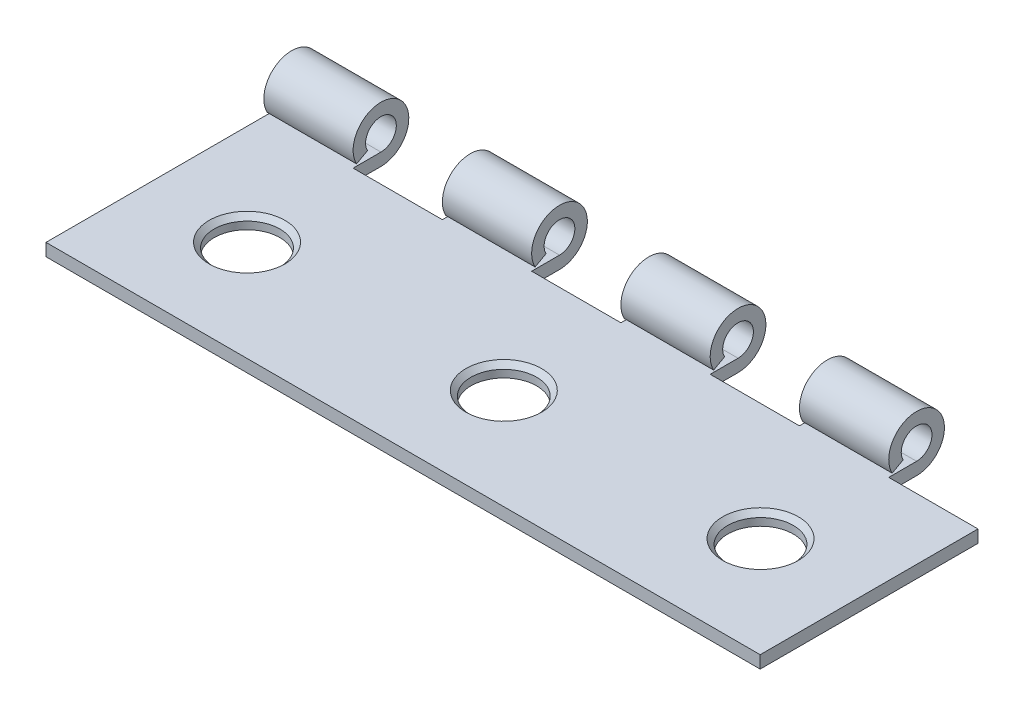
ISO-10303-21;
HEADER;
FILE_DESCRIPTION(('STEP AP214'),'2;1');
FILE_NAME('part.step','',(''),(''),'','','');
FILE_SCHEMA(('AUTOMOTIVE_DESIGN { 1 0 10303 214 1 1 1 1 }'));
ENDSEC;
DATA;
#1=APPLICATION_CONTEXT('core data for automotive mechanical design processes');
#2=APPLICATION_PROTOCOL_DEFINITION('international standard','automotive_design',2000,#1);
#3=PRODUCT_CONTEXT('',#1,'mechanical');
#4=PRODUCT('Part','Part','',(#3));
#5=PRODUCT_RELATED_PRODUCT_CATEGORY('part','',(#4));
#6=PRODUCT_DEFINITION_FORMATION('','',#4);
#7=PRODUCT_DEFINITION_CONTEXT('part definition',#1,'design');
#8=PRODUCT_DEFINITION('design','',#6,#7);
#9=PRODUCT_DEFINITION_SHAPE('','',#8);
#10=(LENGTH_UNIT() NAMED_UNIT(*) SI_UNIT(.MILLI.,.METRE.));
#11=(NAMED_UNIT(*) PLANE_ANGLE_UNIT() SI_UNIT($,.RADIAN.));
#12=(NAMED_UNIT(*) SI_UNIT($,.STERADIAN.) SOLID_ANGLE_UNIT());
#13=UNCERTAINTY_MEASURE_WITH_UNIT(LENGTH_MEASURE(1.E-05),#10,'distance_accuracy_value','');
#14=(GEOMETRIC_REPRESENTATION_CONTEXT(3) GLOBAL_UNCERTAINTY_ASSIGNED_CONTEXT((#13)) GLOBAL_UNIT_ASSIGNED_CONTEXT((#10,
#11,#12)) REPRESENTATION_CONTEXT('',''));
#15=CARTESIAN_POINT('',(0.,0.,0.));
#16=DIRECTION('',(0.,0.,1.));
#17=DIRECTION('',(1.,0.,0.));
#18=AXIS2_PLACEMENT_3D('',#15,#16,#17);
#19=CARTESIAN_POINT('',(25.4,0.,0.));
#20=DIRECTION('',(-1.,0.,0.));
#21=DIRECTION('',(0.,0.,1.));
#22=AXIS2_PLACEMENT_3D('',#19,#20,#21);
#23=CYLINDRICAL_SURFACE('',#22,1.0922);
#24=DIRECTION('',(-1.,0.,0.));
#25=VECTOR('',#24,1.);
#26=CARTESIAN_POINT('',(25.4,-0.527292872124992,0.956484744784869));
#27=LINE('',#26,#25);
#28=CARTESIAN_POINT('',(6.35,-0.527292872124992,0.956484744784869));
#29=VERTEX_POINT('',#28);
#30=CARTESIAN_POINT('',(0.,-0.527292872124992,0.956484744784869));
#31=VERTEX_POINT('',#30);
#32=EDGE_CURVE('E379',#29,#31,#27,.T.);
#33=ORIENTED_EDGE('',*,*,#32,.T.);
#34=CARTESIAN_POINT('',(0.,0.,0.));
#35=DIRECTION('',(1.,0.,0.));
#36=DIRECTION('',(0.,0.,-1.));
#37=AXIS2_PLACEMENT_3D('',#34,#35,#36);
#38=CIRCLE('',#37,1.0922);
#39=CARTESIAN_POINT('',(0.,-1.0922,0.));
#40=VERTEX_POINT('',#39);
#41=EDGE_CURVE('E311',#31,#40,#38,.F.);
#42=ORIENTED_EDGE('',*,*,#41,.T.);
#43=DIRECTION('',(-1.,0.,0.));
#44=VECTOR('',#43,1.);
#45=CARTESIAN_POINT('',(25.4,-1.0922,0.));
#46=LINE('',#45,#44);
#47=CARTESIAN_POINT('',(6.35,-1.0922,0.));
#48=VERTEX_POINT('',#47);
#49=EDGE_CURVE('E398',#48,#40,#46,.T.);
#50=ORIENTED_EDGE('',*,*,#49,.F.);
#51=CARTESIAN_POINT('',(6.35,0.,0.));
#52=DIRECTION('',(-1.,0.,0.));
#53=DIRECTION('',(0.,0.,1.));
#54=AXIS2_PLACEMENT_3D('',#51,#52,#53);
#55=CIRCLE('',#54,1.0922);
#56=EDGE_CURVE('E275',#48,#29,#55,.F.);
#57=ORIENTED_EDGE('',*,*,#56,.T.);
#58=EDGE_LOOP('',(#33,#42,#50,#57));
#59=FACE_BOUND('',#58,.T.);
#60=ADVANCED_FACE('F36',(#59),#23,.F.);
#61=CARTESIAN_POINT('',(19.05,-0.527292872124992,0.956484744784869));
#62=VERTEX_POINT('',#61);
#63=CARTESIAN_POINT('',(12.7,-0.527292872124992,0.956484744784869));
#64=VERTEX_POINT('',#63);
#65=EDGE_CURVE('E477',#62,#64,#27,.T.);
#66=ORIENTED_EDGE('',*,*,#65,.T.);
#67=CARTESIAN_POINT('',(12.7,0.,0.));
#68=DIRECTION('',(1.,0.,0.));
#69=DIRECTION('',(0.,0.,-1.));
#70=AXIS2_PLACEMENT_3D('',#67,#68,#69);
#71=CIRCLE('',#70,1.0922);
#72=CARTESIAN_POINT('',(12.7,-1.0922,0.));
#73=VERTEX_POINT('',#72);
#74=EDGE_CURVE('E289',#64,#73,#71,.F.);
#75=ORIENTED_EDGE('',*,*,#74,.T.);
#76=CARTESIAN_POINT('',(19.05,-1.0922,0.));
#77=VERTEX_POINT('',#76);
#78=EDGE_CURVE('E403',#77,#73,#46,.T.);
#79=ORIENTED_EDGE('',*,*,#78,.F.);
#80=CARTESIAN_POINT('',(19.05,0.,0.));
#81=DIRECTION('',(-1.,0.,0.));
#82=DIRECTION('',(0.,0.,1.));
#83=AXIS2_PLACEMENT_3D('',#80,#81,#82);
#84=CIRCLE('',#83,1.0922);
#85=EDGE_CURVE('E264',#77,#62,#84,.F.);
#86=ORIENTED_EDGE('',*,*,#85,.T.);
#87=EDGE_LOOP('',(#66,#75,#79,#86));
#88=FACE_BOUND('',#87,.T.);
#89=ADVANCED_FACE('F503',(#88),#23,.F.);
#90=CARTESIAN_POINT('',(25.4,0.,0.));
#91=DIRECTION('',(-1.,0.,0.));
#92=DIRECTION('',(0.,0.,1.));
#93=AXIS2_PLACEMENT_3D('',#90,#91,#92);
#94=CYLINDRICAL_SURFACE('',#93,1.98120000000008);
#95=CARTESIAN_POINT('',(0.,0.,0.));
#96=DIRECTION('',(1.,0.,0.));
#97=DIRECTION('',(0.,0.,-1.));
#98=AXIS2_PLACEMENT_3D('',#95,#96,#97);
#99=CIRCLE('',#98,1.98120000000008);
#100=CARTESIAN_POINT('',(0.,-1.9812,0.));
#101=VERTEX_POINT('',#100);
#102=CARTESIAN_POINT('',(0.,-0.956484744784869,1.7350188393772));
#103=VERTEX_POINT('',#102);
#104=EDGE_CURVE('E225',#101,#103,#99,.T.);
#105=ORIENTED_EDGE('',*,*,#104,.T.);
#106=DIRECTION('',(-1.,0.,0.));
#107=VECTOR('',#106,1.);
#108=CARTESIAN_POINT('',(25.4,-0.956484744784869,1.7350188393772));
#109=LINE('',#108,#107);
#110=CARTESIAN_POINT('',(6.35,-0.956484744784869,1.7350188393772));
#111=VERTEX_POINT('',#110);
#112=EDGE_CURVE('E382',#111,#103,#109,.T.);
#113=ORIENTED_EDGE('',*,*,#112,.F.);
#114=CARTESIAN_POINT('',(6.35,0.,0.));
#115=DIRECTION('',(-1.,0.,0.));
#116=DIRECTION('',(0.,0.,1.));
#117=AXIS2_PLACEMENT_3D('',#114,#115,#116);
#118=CIRCLE('',#117,1.98120000000008);
#119=CARTESIAN_POINT('',(6.35,-1.9812,0.));
#120=VERTEX_POINT('',#119);
#121=EDGE_CURVE('E281',#111,#120,#118,.T.);
#122=ORIENTED_EDGE('',*,*,#121,.T.);
#123=DIRECTION('',(-1.,0.,0.));
#124=VECTOR('',#123,1.);
#125=CARTESIAN_POINT('',(25.4,-1.9812,0.));
#126=LINE('',#125,#124);
#127=EDGE_CURVE('E386',#120,#101,#126,.T.);
#128=ORIENTED_EDGE('',*,*,#127,.T.);
#129=EDGE_LOOP('',(#105,#113,#122,#128));
#130=FACE_BOUND('',#129,.T.);
#131=ADVANCED_FACE('F521',(#130),#94,.T.);
#132=CARTESIAN_POINT('',(12.7,0.,0.));
#133=DIRECTION('',(1.,0.,0.));
#134=DIRECTION('',(0.,0.,-1.));
#135=AXIS2_PLACEMENT_3D('',#132,#133,#134);
#136=CIRCLE('',#135,1.98120000000008);
#137=CARTESIAN_POINT('',(12.7,-1.9812,0.));
#138=VERTEX_POINT('',#137);
#139=CARTESIAN_POINT('',(12.7,-0.956484744784869,1.7350188393772));
#140=VERTEX_POINT('',#139);
#141=EDGE_CURVE('E295',#138,#140,#136,.T.);
#142=ORIENTED_EDGE('',*,*,#141,.T.);
#143=CARTESIAN_POINT('',(19.05,-0.956484744784869,1.7350188393772));
#144=VERTEX_POINT('',#143);
#145=EDGE_CURVE('E485',#144,#140,#109,.T.);
#146=ORIENTED_EDGE('',*,*,#145,.F.);
#147=CARTESIAN_POINT('',(19.05,0.,0.));
#148=DIRECTION('',(-1.,0.,0.));
#149=DIRECTION('',(0.,0.,1.));
#150=AXIS2_PLACEMENT_3D('',#147,#148,#149);
#151=CIRCLE('',#150,1.98120000000008);
#152=CARTESIAN_POINT('',(19.05,-1.9812,0.));
#153=VERTEX_POINT('',#152);
#154=EDGE_CURVE('E270',#144,#153,#151,.T.);
#155=ORIENTED_EDGE('',*,*,#154,.T.);
#156=EDGE_CURVE('E392',#153,#138,#126,.T.);
#157=ORIENTED_EDGE('',*,*,#156,.T.);
#158=EDGE_LOOP('',(#142,#146,#155,#157));
#159=FACE_BOUND('',#158,.T.);
#160=ADVANCED_FACE('F523',(#159),#94,.T.);
#161=CARTESIAN_POINT('',(-6.35,-0.956484744784869,1.7350188393772));
#162=VERTEX_POINT('',#161);
#163=CARTESIAN_POINT('',(-12.7,-0.956484744784869,1.7350188393772));
#164=VERTEX_POINT('',#163);
#165=EDGE_CURVE('E380',#162,#164,#109,.T.);
#166=ORIENTED_EDGE('',*,*,#165,.F.);
#167=CARTESIAN_POINT('',(-6.35,0.,0.));
#168=DIRECTION('',(-1.,0.,0.));
#169=DIRECTION('',(0.,0.,1.));
#170=AXIS2_PLACEMENT_3D('',#167,#168,#169);
#171=CIRCLE('',#170,1.98120000000008);
#172=CARTESIAN_POINT('',(-6.35,-1.9812,0.));
#173=VERTEX_POINT('',#172);
#174=EDGE_CURVE('E306',#162,#173,#171,.T.);
#175=ORIENTED_EDGE('',*,*,#174,.T.);
#176=CARTESIAN_POINT('',(-12.7,-1.9812,0.));
#177=VERTEX_POINT('',#176);
#178=EDGE_CURVE('E384',#173,#177,#126,.T.);
#179=ORIENTED_EDGE('',*,*,#178,.T.);
#180=CARTESIAN_POINT('',(-12.7,0.,0.));
#181=DIRECTION('',(1.,0.,0.));
#182=DIRECTION('',(0.,0.,-1.));
#183=AXIS2_PLACEMENT_3D('',#180,#181,#182);
#184=CIRCLE('',#183,1.98120000000008);
#185=EDGE_CURVE('E342',#177,#164,#184,.T.);
#186=ORIENTED_EDGE('',*,*,#185,.T.);
#187=EDGE_LOOP('',(#166,#175,#179,#186));
#188=FACE_BOUND('',#187,.T.);
#189=ADVANCED_FACE('F569',(#188),#94,.T.);
#190=CARTESIAN_POINT('',(25.4,-0.527292872124992,0.956484744784869));
#191=DIRECTION('',(0.,0.875741388742785,0.482780509178715));
#192=DIRECTION('',(0.,-0.482780509178715,0.875741388742785));
#193=AXIS2_PLACEMENT_3D('',#190,#191,#192);
#194=PLANE('',#193);
#195=ORIENTED_EDGE('',*,*,#112,.T.);
#196=DIRECTION('',(0.,0.482780509178715,-0.875741388742785));
#197=VECTOR('',#196,1.);
#198=CARTESIAN_POINT('',(0.,-0.527292872124992,0.956484744784869));
#199=LINE('',#198,#197);
#200=EDGE_CURVE('E314',#103,#31,#199,.T.);
#201=ORIENTED_EDGE('',*,*,#200,.T.);
#202=ORIENTED_EDGE('',*,*,#32,.F.);
#203=DIRECTION('',(0.,-0.482780509178715,0.875741388742785));
#204=VECTOR('',#203,1.);
#205=CARTESIAN_POINT('',(6.35,-0.527292872124992,0.956484744784869));
#206=LINE('',#205,#204);
#207=EDGE_CURVE('E278',#29,#111,#206,.T.);
#208=ORIENTED_EDGE('',*,*,#207,.T.);
#209=EDGE_LOOP('',(#195,#201,#202,#208));
#210=FACE_BOUND('',#209,.T.);
#211=ADVANCED_FACE('F518',(#210),#194,.F.);
#212=ORIENTED_EDGE('',*,*,#145,.T.);
#213=DIRECTION('',(0.,0.482780509178715,-0.875741388742785));
#214=VECTOR('',#213,1.);
#215=CARTESIAN_POINT('',(12.7,-0.527292872124992,0.956484744784869));
#216=LINE('',#215,#214);
#217=EDGE_CURVE('E292',#140,#64,#216,.T.);
#218=ORIENTED_EDGE('',*,*,#217,.T.);
#219=ORIENTED_EDGE('',*,*,#65,.F.);
#220=DIRECTION('',(0.,-0.482780509178715,0.875741388742785));
#221=VECTOR('',#220,1.);
#222=CARTESIAN_POINT('',(19.05,-0.527292872124992,0.956484744784869));
#223=LINE('',#222,#221);
#224=EDGE_CURVE('E267',#62,#144,#223,.T.);
#225=ORIENTED_EDGE('',*,*,#224,.T.);
#226=EDGE_LOOP('',(#212,#218,#219,#225));
#227=FACE_BOUND('',#226,.T.);
#228=ADVANCED_FACE('F511',(#227),#194,.F.);
#229=CARTESIAN_POINT('',(-6.35,-1.0922,0.));
#230=VERTEX_POINT('',#229);
#231=CARTESIAN_POINT('',(-12.7,-1.0922,0.));
#232=VERTEX_POINT('',#231);
#233=EDGE_CURVE('E396',#230,#232,#46,.T.);
#234=ORIENTED_EDGE('',*,*,#233,.F.);
#235=CARTESIAN_POINT('',(-6.35,0.,0.));
#236=DIRECTION('',(-1.,0.,0.));
#237=DIRECTION('',(0.,0.,1.));
#238=AXIS2_PLACEMENT_3D('',#235,#236,#237);
#239=CIRCLE('',#238,1.0922);
#240=CARTESIAN_POINT('',(-6.35,-0.527292872124992,0.956484744784869));
#241=VERTEX_POINT('',#240);
#242=EDGE_CURVE('E300',#230,#241,#239,.F.);
#243=ORIENTED_EDGE('',*,*,#242,.T.);
#244=CARTESIAN_POINT('',(-12.7,-0.527292872124992,0.956484744784869));
#245=VERTEX_POINT('',#244);
#246=EDGE_CURVE('E377',#241,#245,#27,.T.);
#247=ORIENTED_EDGE('',*,*,#246,.T.);
#248=CARTESIAN_POINT('',(-12.7,0.,0.));
#249=DIRECTION('',(1.,0.,0.));
#250=DIRECTION('',(0.,0.,-1.));
#251=AXIS2_PLACEMENT_3D('',#248,#249,#250);
#252=CIRCLE('',#251,1.0922);
#253=EDGE_CURVE('E341',#245,#232,#252,.F.);
#254=ORIENTED_EDGE('',*,*,#253,.T.);
#255=EDGE_LOOP('',(#234,#243,#247,#254));
#256=FACE_BOUND('',#255,.T.);
#257=ADVANCED_FACE('F540',(#256),#23,.F.);
#258=ORIENTED_EDGE('',*,*,#246,.F.);
#259=DIRECTION('',(0.,-0.482780509178715,0.875741388742785));
#260=VECTOR('',#259,1.);
#261=CARTESIAN_POINT('',(-6.35,-0.527292872124992,0.956484744784869));
#262=LINE('',#261,#260);
#263=EDGE_CURVE('E303',#241,#162,#262,.T.);
#264=ORIENTED_EDGE('',*,*,#263,.T.);
#265=ORIENTED_EDGE('',*,*,#165,.T.);
#266=DIRECTION('',(0.,0.482780509178715,-0.875741388742785));
#267=VECTOR('',#266,1.);
#268=CARTESIAN_POINT('',(-12.7,-0.527292872124992,0.956484744784869));
#269=LINE('',#268,#267);
#270=EDGE_CURVE('E402',#164,#245,#269,.T.);
#271=ORIENTED_EDGE('',*,*,#270,.T.);
#272=EDGE_LOOP('',(#258,#264,#265,#271));
#273=FACE_BOUND('',#272,.T.);
#274=ADVANCED_FACE('F542',(#273),#194,.F.);
#275=CARTESIAN_POINT('',(-19.05,-1.0922,0.));
#276=VERTEX_POINT('',#275);
#277=CARTESIAN_POINT('',(-25.4,-1.0922,0.));
#278=VERTEX_POINT('',#277);
#279=EDGE_CURVE('E395',#276,#278,#46,.T.);
#280=ORIENTED_EDGE('',*,*,#279,.F.);
#281=CARTESIAN_POINT('',(-19.05,0.,0.));
#282=DIRECTION('',(-1.,0.,0.));
#283=DIRECTION('',(0.,0.,1.));
#284=AXIS2_PLACEMENT_3D('',#281,#282,#283);
#285=CIRCLE('',#284,1.0922);
#286=CARTESIAN_POINT('',(-19.05,-0.527292872124992,0.956484744784869));
#287=VERTEX_POINT('',#286);
#288=EDGE_CURVE('E331',#276,#287,#285,.F.);
#289=ORIENTED_EDGE('',*,*,#288,.T.);
#290=CARTESIAN_POINT('',(-25.4,-0.527292872124992,0.956484744784869));
#291=VERTEX_POINT('',#290);
#292=EDGE_CURVE('E362',#287,#291,#27,.T.);
#293=ORIENTED_EDGE('',*,*,#292,.T.);
#294=CARTESIAN_POINT('',(-25.4,0.,0.));
#295=DIRECTION('',(-1.,0.,0.));
#296=DIRECTION('',(0.,0.,1.));
#297=AXIS2_PLACEMENT_3D('',#294,#295,#296);
#298=CIRCLE('',#297,1.0922);
#299=EDGE_CURVE('E353',#291,#278,#298,.T.);
#300=ORIENTED_EDGE('',*,*,#299,.T.);
#301=EDGE_LOOP('',(#280,#289,#293,#300));
#302=FACE_BOUND('',#301,.T.);
#303=ADVANCED_FACE('F38',(#302),#23,.F.);
#304=CARTESIAN_POINT('',(25.4,-1.0922,17.4752));
#305=DIRECTION('',(0.,-1.,0.));
#306=DIRECTION('',(0.,0.,-1.));
#307=AXIS2_PLACEMENT_3D('',#304,#305,#306);
#308=PLANE('',#307);
#309=CARTESIAN_POINT('',(18.2626,-1.0922,10.3124));
#310=DIRECTION('',(0.,1.,0.));
#311=DIRECTION('',(0.,0.,1.));
#312=AXIS2_PLACEMENT_3D('',#309,#310,#311);
#313=CIRCLE('',#312,2.6924);
#314=CARTESIAN_POINT('',(18.2626,-1.0922,13.0048));
#315=VERTEX_POINT('',#314);
#316=EDGE_CURVE('E251',#315,#315,#313,.T.);
#317=ORIENTED_EDGE('',*,*,#316,.F.);
#318=EDGE_LOOP('',(#317));
#319=FACE_BOUND('',#318,.T.);
#320=CARTESIAN_POINT('',(0.,-1.0922,10.3124));
#321=DIRECTION('',(0.,1.,0.));
#322=DIRECTION('',(0.,0.,1.));
#323=AXIS2_PLACEMENT_3D('',#320,#321,#322);
#324=CIRCLE('',#323,2.6924);
#325=CARTESIAN_POINT('',(0.,-1.0922,13.0048));
#326=VERTEX_POINT('',#325);
#327=EDGE_CURVE('E420',#326,#326,#324,.T.);
#328=ORIENTED_EDGE('',*,*,#327,.F.);
#329=EDGE_LOOP('',(#328));
#330=FACE_BOUND('',#329,.T.);
#331=CARTESIAN_POINT('',(-18.2626,-1.0922,10.3124));
#332=DIRECTION('',(0.,1.,0.));
#333=DIRECTION('',(0.,0.,1.));
#334=AXIS2_PLACEMENT_3D('',#331,#332,#333);
#335=CIRCLE('',#334,2.6924);
#336=CARTESIAN_POINT('',(-18.2626,-1.0922,13.0048));
#337=VERTEX_POINT('',#336);
#338=EDGE_CURVE('E416',#337,#337,#335,.T.);
#339=ORIENTED_EDGE('',*,*,#338,.F.);
#340=EDGE_LOOP('',(#339));
#341=FACE_BOUND('',#340,.T.);
#342=ORIENTED_EDGE('',*,*,#49,.T.);
#343=DIRECTION('',(0.,0.,1.));
#344=VECTOR('',#343,1.);
#345=CARTESIAN_POINT('',(0.,-1.0922,17.4752));
#346=LINE('',#345,#344);
#347=CARTESIAN_POINT('',(0.,-1.0922,1.98120000000012));
#348=VERTEX_POINT('',#347);
#349=EDGE_CURVE('E309',#40,#348,#346,.T.);
#350=ORIENTED_EDGE('',*,*,#349,.T.);
#351=DIRECTION('',(-1.,0.,0.));
#352=VECTOR('',#351,1.);
#353=CARTESIAN_POINT('',(25.4,-1.0922,1.98120000000012));
#354=LINE('',#353,#352);
#355=CARTESIAN_POINT('',(-6.35,-1.0922,1.98120000000012));
#356=VERTEX_POINT('',#355);
#357=EDGE_CURVE('E215',#348,#356,#354,.T.);
#358=ORIENTED_EDGE('',*,*,#357,.T.);
#359=DIRECTION('',(0.,0.,-1.));
#360=VECTOR('',#359,1.);
#361=CARTESIAN_POINT('',(-6.35,-1.0922,17.4752));
#362=LINE('',#361,#360);
#363=EDGE_CURVE('E297',#356,#230,#362,.T.);
#364=ORIENTED_EDGE('',*,*,#363,.T.);
#365=ORIENTED_EDGE('',*,*,#233,.T.);
#366=DIRECTION('',(0.,0.,1.));
#367=VECTOR('',#366,1.);
#368=CARTESIAN_POINT('',(-12.7,-1.0922,17.4752));
#369=LINE('',#368,#367);
#370=CARTESIAN_POINT('',(-12.7,-1.0922,1.98120000000012));
#371=VERTEX_POINT('',#370);
#372=EDGE_CURVE('E345',#232,#371,#369,.T.);
#373=ORIENTED_EDGE('',*,*,#372,.T.);
#374=DIRECTION('',(-1.,0.,0.));
#375=VECTOR('',#374,1.);
#376=CARTESIAN_POINT('',(25.4,-1.0922,1.98120000000011));
#377=LINE('',#376,#375);
#378=CARTESIAN_POINT('',(-19.05,-1.0922,1.98120000000012));
#379=VERTEX_POINT('',#378);
#380=EDGE_CURVE('E350',#371,#379,#377,.T.);
#381=ORIENTED_EDGE('',*,*,#380,.T.);
#382=DIRECTION('',(0.,0.,-1.));
#383=VECTOR('',#382,1.);
#384=CARTESIAN_POINT('',(-19.05,-1.0922,17.4752));
#385=LINE('',#384,#383);
#386=EDGE_CURVE('E336',#379,#276,#385,.T.);
#387=ORIENTED_EDGE('',*,*,#386,.T.);
#388=ORIENTED_EDGE('',*,*,#279,.T.);
#389=DIRECTION('',(0.,0.,1.));
#390=VECTOR('',#389,1.);
#391=CARTESIAN_POINT('',(-25.4,-1.0922,17.4752));
#392=LINE('',#391,#390);
#393=CARTESIAN_POINT('',(-25.4,-1.0922,17.4752));
#394=VERTEX_POINT('',#393);
#395=EDGE_CURVE('E365',#278,#394,#392,.T.);
#396=ORIENTED_EDGE('',*,*,#395,.T.);
#397=DIRECTION('',(-1.,0.,0.));
#398=VECTOR('',#397,1.);
#399=CARTESIAN_POINT('',(25.4,-1.0922,17.4752));
#400=LINE('',#399,#398);
#401=CARTESIAN_POINT('',(25.4,-1.0922,17.4752));
#402=VERTEX_POINT('',#401);
#403=EDGE_CURVE('E391',#402,#394,#400,.T.);
#404=ORIENTED_EDGE('',*,*,#403,.F.);
#405=DIRECTION('',(0.,0.,1.));
#406=VECTOR('',#405,1.);
#407=CARTESIAN_POINT('',(25.4,-1.0922,17.4752));
#408=LINE('',#407,#406);
#409=CARTESIAN_POINT('',(25.4,-1.0922,1.98120000000012));
#410=VERTEX_POINT('',#409);
#411=EDGE_CURVE('E354',#410,#402,#408,.T.);
#412=ORIENTED_EDGE('',*,*,#411,.F.);
#413=DIRECTION('',(-1.,0.,0.));
#414=VECTOR('',#413,1.);
#415=CARTESIAN_POINT('',(25.4,-1.0922,1.98120000000012));
#416=LINE('',#415,#414);
#417=CARTESIAN_POINT('',(19.05,-1.0922,1.98120000000012));
#418=VERTEX_POINT('',#417);
#419=EDGE_CURVE('E218',#410,#418,#416,.T.);
#420=ORIENTED_EDGE('',*,*,#419,.T.);
#421=DIRECTION('',(0.,0.,-1.));
#422=VECTOR('',#421,1.);
#423=CARTESIAN_POINT('',(19.05,-1.0922,17.4752));
#424=LINE('',#423,#422);
#425=EDGE_CURVE('E261',#418,#77,#424,.T.);
#426=ORIENTED_EDGE('',*,*,#425,.T.);
#427=ORIENTED_EDGE('',*,*,#78,.T.);
#428=DIRECTION('',(0.,0.,1.));
#429=VECTOR('',#428,1.);
#430=CARTESIAN_POINT('',(12.7,-1.0922,17.4752));
#431=LINE('',#430,#429);
#432=CARTESIAN_POINT('',(12.7,-1.0922,1.98120000000012));
#433=VERTEX_POINT('',#432);
#434=EDGE_CURVE('E286',#73,#433,#431,.T.);
#435=ORIENTED_EDGE('',*,*,#434,.T.);
#436=DIRECTION('',(-1.,0.,0.));
#437=VECTOR('',#436,1.);
#438=CARTESIAN_POINT('',(25.4,-1.0922,1.98120000000012));
#439=LINE('',#438,#437);
#440=CARTESIAN_POINT('',(6.35,-1.0922,1.98120000000012));
#441=VERTEX_POINT('',#440);
#442=EDGE_CURVE('E283',#433,#441,#439,.T.);
#443=ORIENTED_EDGE('',*,*,#442,.T.);
#444=DIRECTION('',(0.,0.,-1.));
#445=VECTOR('',#444,1.);
#446=CARTESIAN_POINT('',(6.35,-1.0922,17.4752));
#447=LINE('',#446,#445);
#448=EDGE_CURVE('E272',#441,#48,#447,.T.);
#449=ORIENTED_EDGE('',*,*,#448,.T.);
#450=EDGE_LOOP('',(#342,#350,#358,#364,#365,#373,#381,#387,#388,#396,#404,#412,#420,#426,#427,
#435,#443,#449));
#451=FACE_BOUND('',#450,.T.);
#452=ADVANCED_FACE('F453',(#319,#330,#341,#451),#308,.F.);
#453=CARTESIAN_POINT('',(25.4,-1.9812,17.4752));
#454=DIRECTION('',(0.,0.,-1.));
#455=DIRECTION('',(-1.,0.,0.));
#456=AXIS2_PLACEMENT_3D('',#453,#454,#455);
#457=PLANE('',#456);
#458=DIRECTION('',(0.,-1.,0.));
#459=VECTOR('',#458,1.);
#460=CARTESIAN_POINT('',(-25.4,-1.9812,17.4752));
#461=LINE('',#460,#459);
#462=CARTESIAN_POINT('',(-25.4,-1.9812,17.4752));
#463=VERTEX_POINT('',#462);
#464=EDGE_CURVE('E367',#394,#463,#461,.T.);
#465=ORIENTED_EDGE('',*,*,#464,.T.);
#466=DIRECTION('',(-1.,0.,0.));
#467=VECTOR('',#466,1.);
#468=CARTESIAN_POINT('',(25.4,-1.9812,17.4752));
#469=LINE('',#468,#467);
#470=CARTESIAN_POINT('',(25.4,-1.9812,17.4752));
#471=VERTEX_POINT('',#470);
#472=EDGE_CURVE('E388',#471,#463,#469,.T.);
#473=ORIENTED_EDGE('',*,*,#472,.F.);
#474=DIRECTION('',(0.,-1.,0.));
#475=VECTOR('',#474,1.);
#476=CARTESIAN_POINT('',(25.4,-1.9812,17.4752));
#477=LINE('',#476,#475);
#478=EDGE_CURVE('E356',#402,#471,#477,.T.);
#479=ORIENTED_EDGE('',*,*,#478,.F.);
#480=ORIENTED_EDGE('',*,*,#403,.T.);
#481=EDGE_LOOP('',(#465,#473,#479,#480));
#482=FACE_BOUND('',#481,.T.);
#483=ADVANCED_FACE('F456',(#482),#457,.F.);
#484=CARTESIAN_POINT('',(25.4,-1.9812,0.));
#485=DIRECTION('',(0.,1.,0.));
#486=DIRECTION('',(0.,0.,1.));
#487=AXIS2_PLACEMENT_3D('',#484,#485,#486);
#488=PLANE('',#487);
#489=CARTESIAN_POINT('',(18.2626,-1.9812,10.3124));
#490=DIRECTION('',(0.,1.,0.));
#491=DIRECTION('',(0.,0.,1.));
#492=AXIS2_PLACEMENT_3D('',#489,#490,#491);
#493=CIRCLE('',#492,2.3368);
#494=CARTESIAN_POINT('',(18.2626,-1.9812,12.6492));
#495=VERTEX_POINT('',#494);
#496=EDGE_CURVE('E411',#495,#495,#493,.T.);
#497=ORIENTED_EDGE('',*,*,#496,.T.);
#498=EDGE_LOOP('',(#497));
#499=FACE_BOUND('',#498,.T.);
#500=CARTESIAN_POINT('',(0.,-1.9812,10.3124));
#501=DIRECTION('',(0.,1.,0.));
#502=DIRECTION('',(0.,0.,1.));
#503=AXIS2_PLACEMENT_3D('',#500,#501,#502);
#504=CIRCLE('',#503,2.3368);
#505=CARTESIAN_POINT('',(0.,-1.9812,12.6492));
#506=VERTEX_POINT('',#505);
#507=EDGE_CURVE('E431',#506,#506,#504,.T.);
#508=ORIENTED_EDGE('',*,*,#507,.T.);
#509=EDGE_LOOP('',(#508));
#510=FACE_BOUND('',#509,.T.);
#511=CARTESIAN_POINT('',(-18.2626,-1.9812,10.3124));
#512=DIRECTION('',(0.,1.,0.));
#513=DIRECTION('',(0.,0.,1.));
#514=AXIS2_PLACEMENT_3D('',#511,#512,#513);
#515=CIRCLE('',#514,2.3368);
#516=CARTESIAN_POINT('',(-18.2626,-1.9812,12.6492));
#517=VERTEX_POINT('',#516);
#518=EDGE_CURVE('E428',#517,#517,#515,.T.);
#519=ORIENTED_EDGE('',*,*,#518,.T.);
#520=EDGE_LOOP('',(#519));
#521=FACE_BOUND('',#520,.T.);
#522=DIRECTION('',(1.,0.,0.));
#523=VECTOR('',#522,1.);
#524=CARTESIAN_POINT('',(0.,-1.9812,1.98120000000012));
#525=LINE('',#524,#523);
#526=CARTESIAN_POINT('',(-6.35,-1.9812,1.98120000000012));
#527=VERTEX_POINT('',#526);
#528=CARTESIAN_POINT('',(0.,-1.9812,1.98120000000012));
#529=VERTEX_POINT('',#528);
#530=EDGE_CURVE('E53',#527,#529,#525,.T.);
#531=ORIENTED_EDGE('',*,*,#530,.T.);
#532=DIRECTION('',(0.,0.,-1.));
#533=VECTOR('',#532,1.);
#534=CARTESIAN_POINT('',(0.,-1.9812,-1.98120000000012));
#535=LINE('',#534,#533);
#536=EDGE_CURVE('E222',#529,#101,#535,.T.);
#537=ORIENTED_EDGE('',*,*,#536,.T.);
#538=ORIENTED_EDGE('',*,*,#127,.F.);
#539=DIRECTION('',(0.,0.,1.));
#540=VECTOR('',#539,1.);
#541=CARTESIAN_POINT('',(6.35,-1.9812,0.));
#542=LINE('',#541,#540);
#543=CARTESIAN_POINT('',(6.35,-1.9812,1.98120000000012));
#544=VERTEX_POINT('',#543);
#545=EDGE_CURVE('E45',#120,#544,#542,.T.);
#546=ORIENTED_EDGE('',*,*,#545,.T.);
#547=DIRECTION('',(1.,0.,0.));
#548=VECTOR('',#547,1.);
#549=CARTESIAN_POINT('',(12.7,-1.9812,1.98120000000012));
#550=LINE('',#549,#548);
#551=CARTESIAN_POINT('',(12.7,-1.9812,1.98120000000012));
#552=VERTEX_POINT('',#551);
#553=EDGE_CURVE('E61',#544,#552,#550,.T.);
#554=ORIENTED_EDGE('',*,*,#553,.T.);
#555=DIRECTION('',(0.,0.,-1.));
#556=VECTOR('',#555,1.);
#557=CARTESIAN_POINT('',(12.7,-1.9812,-1.98120000000012));
#558=LINE('',#557,#556);
#559=EDGE_CURVE('E238',#552,#138,#558,.T.);
#560=ORIENTED_EDGE('',*,*,#559,.T.);
#561=ORIENTED_EDGE('',*,*,#156,.F.);
#562=DIRECTION('',(0.,0.,1.));
#563=VECTOR('',#562,1.);
#564=CARTESIAN_POINT('',(19.05,-1.9812,1.98120000000012));
#565=LINE('',#564,#563);
#566=CARTESIAN_POINT('',(19.05,-1.9812,1.98120000000012));
#567=VERTEX_POINT('',#566);
#568=EDGE_CURVE('E247',#153,#567,#565,.T.);
#569=ORIENTED_EDGE('',*,*,#568,.T.);
#570=DIRECTION('',(1.,0.,0.));
#571=VECTOR('',#570,1.);
#572=CARTESIAN_POINT('',(25.4,-1.9812,1.98120000000012));
#573=LINE('',#572,#571);
#574=CARTESIAN_POINT('',(25.4,-1.9812,1.98120000000012));
#575=VERTEX_POINT('',#574);
#576=EDGE_CURVE('E250',#567,#575,#573,.T.);
#577=ORIENTED_EDGE('',*,*,#576,.T.);
#578=DIRECTION('',(0.,0.,-1.));
#579=VECTOR('',#578,1.);
#580=CARTESIAN_POINT('',(25.4,-1.9812,0.));
#581=LINE('',#580,#579);
#582=EDGE_CURVE('E359',#471,#575,#581,.T.);
#583=ORIENTED_EDGE('',*,*,#582,.F.);
#584=ORIENTED_EDGE('',*,*,#472,.T.);
#585=DIRECTION('',(0.,0.,-1.));
#586=VECTOR('',#585,1.);
#587=CARTESIAN_POINT('',(-25.4,-1.9812,0.));
#588=LINE('',#587,#586);
#589=CARTESIAN_POINT('',(-25.4,-1.9812,0.));
#590=VERTEX_POINT('',#589);
#591=EDGE_CURVE('E369',#463,#590,#588,.T.);
#592=ORIENTED_EDGE('',*,*,#591,.T.);
#593=CARTESIAN_POINT('',(-19.05,-1.9812,0.));
#594=VERTEX_POINT('',#593);
#595=EDGE_CURVE('E387',#594,#590,#126,.T.);
#596=ORIENTED_EDGE('',*,*,#595,.F.);
#597=DIRECTION('',(0.,0.,1.));
#598=VECTOR('',#597,1.);
#599=CARTESIAN_POINT('',(-19.05,-1.9812,1.98120000000012));
#600=LINE('',#599,#598);
#601=CARTESIAN_POINT('',(-19.05,-1.9812,1.98120000000012));
#602=VERTEX_POINT('',#601);
#603=EDGE_CURVE('E321',#594,#602,#600,.T.);
#604=ORIENTED_EDGE('',*,*,#603,.T.);
#605=DIRECTION('',(1.,0.,0.));
#606=VECTOR('',#605,1.);
#607=CARTESIAN_POINT('',(-12.7,-1.9812,1.98120000000012));
#608=LINE('',#607,#606);
#609=CARTESIAN_POINT('',(-12.7,-1.9812,1.98120000000012));
#610=VERTEX_POINT('',#609);
#611=EDGE_CURVE('E324',#602,#610,#608,.T.);
#612=ORIENTED_EDGE('',*,*,#611,.T.);
#613=DIRECTION('',(0.,0.,-1.));
#614=VECTOR('',#613,1.);
#615=CARTESIAN_POINT('',(-12.7,-1.9812,-1.98120000000012));
#616=LINE('',#615,#614);
#617=EDGE_CURVE('E318',#610,#177,#616,.T.);
#618=ORIENTED_EDGE('',*,*,#617,.T.);
#619=ORIENTED_EDGE('',*,*,#178,.F.);
#620=DIRECTION('',(0.,0.,1.));
#621=VECTOR('',#620,1.);
#622=CARTESIAN_POINT('',(-6.35,-1.9812,0.));
#623=LINE('',#622,#621);
#624=EDGE_CURVE('E11',#173,#527,#623,.T.);
#625=ORIENTED_EDGE('',*,*,#624,.T.);
#626=EDGE_LOOP('',(#531,#537,#538,#546,#554,#560,#561,#569,#577,#583,#584,#592,#596,#604,#612,
#618,#619,#625));
#627=FACE_BOUND('',#626,.T.);
#628=ADVANCED_FACE('F231',(#499,#510,#521,#627),#488,.F.);
#629=CARTESIAN_POINT('',(-19.05,-0.956484744784869,1.7350188393772));
#630=VERTEX_POINT('',#629);
#631=CARTESIAN_POINT('',(-25.4,-0.956484744784869,1.7350188393772));
#632=VERTEX_POINT('',#631);
#633=EDGE_CURVE('E383',#630,#632,#109,.T.);
#634=ORIENTED_EDGE('',*,*,#633,.F.);
#635=CARTESIAN_POINT('',(-19.05,0.,0.));
#636=DIRECTION('',(-1.,0.,0.));
#637=DIRECTION('',(0.,0.,1.));
#638=AXIS2_PLACEMENT_3D('',#635,#636,#637);
#639=CIRCLE('',#638,1.98120000000008);
#640=EDGE_CURVE('E334',#630,#594,#639,.T.);
#641=ORIENTED_EDGE('',*,*,#640,.T.);
#642=ORIENTED_EDGE('',*,*,#595,.T.);
#643=CARTESIAN_POINT('',(-25.4,0.,0.));
#644=DIRECTION('',(1.,0.,0.));
#645=DIRECTION('',(0.,0.,1.));
#646=AXIS2_PLACEMENT_3D('',#643,#644,#645);
#647=CIRCLE('',#646,1.98120000000008);
#648=EDGE_CURVE('E372',#590,#632,#647,.T.);
#649=ORIENTED_EDGE('',*,*,#648,.T.);
#650=EDGE_LOOP('',(#634,#641,#642,#649));
#651=FACE_BOUND('',#650,.T.);
#652=ADVANCED_FACE('F482',(#651),#94,.T.);
#653=ORIENTED_EDGE('',*,*,#292,.F.);
#654=DIRECTION('',(0.,-0.482780509178715,0.875741388742785));
#655=VECTOR('',#654,1.);
#656=CARTESIAN_POINT('',(-19.05,-0.527292872124992,0.956484744784869));
#657=LINE('',#656,#655);
#658=EDGE_CURVE('E399',#287,#630,#657,.T.);
#659=ORIENTED_EDGE('',*,*,#658,.T.);
#660=ORIENTED_EDGE('',*,*,#633,.T.);
#661=DIRECTION('',(0.,0.482780509178715,-0.875741388742785));
#662=VECTOR('',#661,1.);
#663=CARTESIAN_POINT('',(-25.4,-0.527292872124992,0.956484744784869));
#664=LINE('',#663,#662);
#665=EDGE_CURVE('E357',#632,#291,#664,.T.);
#666=ORIENTED_EDGE('',*,*,#665,.T.);
#667=EDGE_LOOP('',(#653,#659,#660,#666));
#668=FACE_BOUND('',#667,.T.);
#669=ADVANCED_FACE('F478',(#668),#194,.F.);
#670=CARTESIAN_POINT('',(25.4,0.,0.));
#671=DIRECTION('',(-1.,0.,0.));
#672=DIRECTION('',(0.,0.,1.));
#673=AXIS2_PLACEMENT_3D('',#670,#671,#672);
#674=PLANE('',#673);
#675=ORIENTED_EDGE('',*,*,#582,.T.);
#676=DIRECTION('',(0.,1.,0.));
#677=VECTOR('',#676,1.);
#678=CARTESIAN_POINT('',(25.4,-1.9812,1.98120000000012));
#679=LINE('',#678,#677);
#680=EDGE_CURVE('E241',#575,#410,#679,.T.);
#681=ORIENTED_EDGE('',*,*,#680,.T.);
#682=ORIENTED_EDGE('',*,*,#411,.T.);
#683=ORIENTED_EDGE('',*,*,#478,.T.);
#684=EDGE_LOOP('',(#675,#681,#682,#683));
#685=FACE_BOUND('',#684,.T.);
#686=ADVANCED_FACE('F492',(#685),#674,.F.);
#687=CARTESIAN_POINT('',(-25.4,0.,0.));
#688=DIRECTION('',(-1.,0.,0.));
#689=DIRECTION('',(0.,0.,1.));
#690=AXIS2_PLACEMENT_3D('',#687,#688,#689);
#691=PLANE('',#690);
#692=ORIENTED_EDGE('',*,*,#299,.F.);
#693=ORIENTED_EDGE('',*,*,#665,.F.);
#694=ORIENTED_EDGE('',*,*,#648,.F.);
#695=ORIENTED_EDGE('',*,*,#591,.F.);
#696=ORIENTED_EDGE('',*,*,#464,.F.);
#697=ORIENTED_EDGE('',*,*,#395,.F.);
#698=EDGE_LOOP('',(#692,#693,#694,#695,#696,#697));
#699=FACE_BOUND('',#698,.T.);
#700=ADVANCED_FACE('F472',(#699),#691,.T.);
#701=CARTESIAN_POINT('',(-12.7,-1.9812,1.98120000000012));
#702=DIRECTION('',(0.,0.,1.));
#703=DIRECTION('',(1.,0.,0.));
#704=AXIS2_PLACEMENT_3D('',#701,#702,#703);
#705=PLANE('',#704);
#706=DIRECTION('',(0.,1.,0.));
#707=VECTOR('',#706,1.);
#708=CARTESIAN_POINT('',(-12.7,-1.9812,1.98120000000012));
#709=LINE('',#708,#707);
#710=EDGE_CURVE('E328',#610,#371,#709,.T.);
#711=ORIENTED_EDGE('',*,*,#710,.F.);
#712=ORIENTED_EDGE('',*,*,#611,.F.);
#713=DIRECTION('',(0.,1.,0.));
#714=VECTOR('',#713,1.);
#715=CARTESIAN_POINT('',(-19.05,-1.9812,1.98120000000012));
#716=LINE('',#715,#714);
#717=EDGE_CURVE('E327',#602,#379,#716,.T.);
#718=ORIENTED_EDGE('',*,*,#717,.T.);
#719=ORIENTED_EDGE('',*,*,#380,.F.);
#720=EDGE_LOOP('',(#711,#712,#718,#719));
#721=FACE_BOUND('',#720,.T.);
#722=ADVANCED_FACE('F564',(#721),#705,.F.);
#723=CARTESIAN_POINT('',(-12.7,-1.9812,-1.98120000000012));
#724=DIRECTION('',(1.,0.,0.));
#725=DIRECTION('',(0.,0.,-1.));
#726=AXIS2_PLACEMENT_3D('',#723,#724,#725);
#727=PLANE('',#726);
#728=ORIENTED_EDGE('',*,*,#253,.F.);
#729=ORIENTED_EDGE('',*,*,#270,.F.);
#730=ORIENTED_EDGE('',*,*,#185,.F.);
#731=ORIENTED_EDGE('',*,*,#617,.F.);
#732=ORIENTED_EDGE('',*,*,#710,.T.);
#733=ORIENTED_EDGE('',*,*,#372,.F.);
#734=EDGE_LOOP('',(#728,#729,#730,#731,#732,#733));
#735=FACE_BOUND('',#734,.T.);
#736=ADVANCED_FACE('F558',(#735),#727,.F.);
#737=CARTESIAN_POINT('',(-19.05,-1.9812,1.98120000000012));
#738=DIRECTION('',(-1.,0.,0.));
#739=DIRECTION('',(0.,0.,1.));
#740=AXIS2_PLACEMENT_3D('',#737,#738,#739);
#741=PLANE('',#740);
#742=ORIENTED_EDGE('',*,*,#640,.F.);
#743=ORIENTED_EDGE('',*,*,#658,.F.);
#744=ORIENTED_EDGE('',*,*,#288,.F.);
#745=ORIENTED_EDGE('',*,*,#386,.F.);
#746=ORIENTED_EDGE('',*,*,#717,.F.);
#747=ORIENTED_EDGE('',*,*,#603,.F.);
#748=EDGE_LOOP('',(#742,#743,#744,#745,#746,#747));
#749=FACE_BOUND('',#748,.T.);
#750=ADVANCED_FACE('F566',(#749),#741,.F.);
#751=CARTESIAN_POINT('',(19.05,-1.9812,1.98120000000012));
#752=DIRECTION('',(-1.,0.,0.));
#753=DIRECTION('',(0.,0.,1.));
#754=AXIS2_PLACEMENT_3D('',#751,#752,#753);
#755=PLANE('',#754);
#756=ORIENTED_EDGE('',*,*,#154,.F.);
#757=ORIENTED_EDGE('',*,*,#224,.F.);
#758=ORIENTED_EDGE('',*,*,#85,.F.);
#759=ORIENTED_EDGE('',*,*,#425,.F.);
#760=DIRECTION('',(0.,1.,0.));
#761=VECTOR('',#760,1.);
#762=CARTESIAN_POINT('',(19.05,-1.9812,1.98120000000012));
#763=LINE('',#762,#761);
#764=EDGE_CURVE('E254',#567,#418,#763,.T.);
#765=ORIENTED_EDGE('',*,*,#764,.F.);
#766=ORIENTED_EDGE('',*,*,#568,.F.);
#767=EDGE_LOOP('',(#756,#757,#758,#759,#765,#766));
#768=FACE_BOUND('',#767,.T.);
#769=ADVANCED_FACE('F500',(#768),#755,.F.);
#770=CARTESIAN_POINT('',(25.4,-1.9812,1.98120000000012));
#771=DIRECTION('',(0.,0.,1.));
#772=DIRECTION('',(1.,0.,0.));
#773=AXIS2_PLACEMENT_3D('',#770,#771,#772);
#774=PLANE('',#773);
#775=ORIENTED_EDGE('',*,*,#680,.F.);
#776=ORIENTED_EDGE('',*,*,#576,.F.);
#777=ORIENTED_EDGE('',*,*,#764,.T.);
#778=ORIENTED_EDGE('',*,*,#419,.F.);
#779=EDGE_LOOP('',(#775,#776,#777,#778));
#780=FACE_BOUND('',#779,.T.);
#781=ADVANCED_FACE('F495',(#780),#774,.F.);
#782=CARTESIAN_POINT('',(12.7,-1.9812,-1.98120000000012));
#783=DIRECTION('',(1.,0.,0.));
#784=DIRECTION('',(0.,0.,-1.));
#785=AXIS2_PLACEMENT_3D('',#782,#783,#784);
#786=PLANE('',#785);
#787=ORIENTED_EDGE('',*,*,#559,.F.);
#788=DIRECTION('',(0.,1.,0.));
#789=VECTOR('',#788,1.);
#790=CARTESIAN_POINT('',(12.7,-1.9812,1.98120000000012));
#791=LINE('',#790,#789);
#792=EDGE_CURVE('E229',#552,#433,#791,.T.);
#793=ORIENTED_EDGE('',*,*,#792,.T.);
#794=ORIENTED_EDGE('',*,*,#434,.F.);
#795=ORIENTED_EDGE('',*,*,#74,.F.);
#796=ORIENTED_EDGE('',*,*,#217,.F.);
#797=ORIENTED_EDGE('',*,*,#141,.F.);
#798=EDGE_LOOP('',(#787,#793,#794,#795,#796,#797));
#799=FACE_BOUND('',#798,.T.);
#800=ADVANCED_FACE('F508',(#799),#786,.F.);
#801=CARTESIAN_POINT('',(12.7,-1.9812,1.98120000000012));
#802=DIRECTION('',(0.,0.,1.));
#803=DIRECTION('',(1.,0.,0.));
#804=AXIS2_PLACEMENT_3D('',#801,#802,#803);
#805=PLANE('',#804);
#806=ORIENTED_EDGE('',*,*,#792,.F.);
#807=ORIENTED_EDGE('',*,*,#553,.F.);
#808=DIRECTION('',(0.,1.,0.));
#809=VECTOR('',#808,1.);
#810=CARTESIAN_POINT('',(6.35,-1.9812,1.98120000000012));
#811=LINE('',#810,#809);
#812=EDGE_CURVE('E243',#544,#441,#811,.T.);
#813=ORIENTED_EDGE('',*,*,#812,.T.);
#814=ORIENTED_EDGE('',*,*,#442,.F.);
#815=EDGE_LOOP('',(#806,#807,#813,#814));
#816=FACE_BOUND('',#815,.T.);
#817=ADVANCED_FACE('F526',(#816),#805,.F.);
#818=CARTESIAN_POINT('',(6.35,-1.9812,1.98120000000012));
#819=DIRECTION('',(-1.,0.,0.));
#820=DIRECTION('',(0.,0.,1.));
#821=AXIS2_PLACEMENT_3D('',#818,#819,#820);
#822=PLANE('',#821);
#823=ORIENTED_EDGE('',*,*,#121,.F.);
#824=ORIENTED_EDGE('',*,*,#207,.F.);
#825=ORIENTED_EDGE('',*,*,#56,.F.);
#826=ORIENTED_EDGE('',*,*,#448,.F.);
#827=ORIENTED_EDGE('',*,*,#812,.F.);
#828=ORIENTED_EDGE('',*,*,#545,.F.);
#829=EDGE_LOOP('',(#823,#824,#825,#826,#827,#828));
#830=FACE_BOUND('',#829,.T.);
#831=ADVANCED_FACE('F525',(#830),#822,.F.);
#832=CARTESIAN_POINT('',(0.,-1.9812,-1.98120000000012));
#833=DIRECTION('',(1.,0.,0.));
#834=DIRECTION('',(0.,0.,-1.));
#835=AXIS2_PLACEMENT_3D('',#832,#833,#834);
#836=PLANE('',#835);
#837=ORIENTED_EDGE('',*,*,#536,.F.);
#838=DIRECTION('',(0.,1.,0.));
#839=VECTOR('',#838,1.);
#840=CARTESIAN_POINT('',(0.,-1.9812,1.98120000000012));
#841=LINE('',#840,#839);
#842=EDGE_CURVE('E211',#529,#348,#841,.T.);
#843=ORIENTED_EDGE('',*,*,#842,.T.);
#844=ORIENTED_EDGE('',*,*,#349,.F.);
#845=ORIENTED_EDGE('',*,*,#41,.F.);
#846=ORIENTED_EDGE('',*,*,#200,.F.);
#847=ORIENTED_EDGE('',*,*,#104,.F.);
#848=EDGE_LOOP('',(#837,#843,#844,#845,#846,#847));
#849=FACE_BOUND('',#848,.T.);
#850=ADVANCED_FACE('F223',(#849),#836,.F.);
#851=CARTESIAN_POINT('',(0.,-1.9812,1.98120000000012));
#852=DIRECTION('',(0.,0.,1.));
#853=DIRECTION('',(1.,0.,0.));
#854=AXIS2_PLACEMENT_3D('',#851,#852,#853);
#855=PLANE('',#854);
#856=ORIENTED_EDGE('',*,*,#842,.F.);
#857=ORIENTED_EDGE('',*,*,#530,.F.);
#858=DIRECTION('',(0.,1.,0.));
#859=VECTOR('',#858,1.);
#860=CARTESIAN_POINT('',(-6.35,-1.9812,1.98120000000012));
#861=LINE('',#860,#859);
#862=EDGE_CURVE('E219',#527,#356,#861,.T.);
#863=ORIENTED_EDGE('',*,*,#862,.T.);
#864=ORIENTED_EDGE('',*,*,#357,.F.);
#865=EDGE_LOOP('',(#856,#857,#863,#864));
#866=FACE_BOUND('',#865,.T.);
#867=ADVANCED_FACE('F213',(#866),#855,.F.);
#868=CARTESIAN_POINT('',(-6.35,-1.9812,1.98120000000012));
#869=DIRECTION('',(-1.,0.,0.));
#870=DIRECTION('',(0.,0.,1.));
#871=AXIS2_PLACEMENT_3D('',#868,#869,#870);
#872=PLANE('',#871);
#873=ORIENTED_EDGE('',*,*,#174,.F.);
#874=ORIENTED_EDGE('',*,*,#263,.F.);
#875=ORIENTED_EDGE('',*,*,#242,.F.);
#876=ORIENTED_EDGE('',*,*,#363,.F.);
#877=ORIENTED_EDGE('',*,*,#862,.F.);
#878=ORIENTED_EDGE('',*,*,#624,.F.);
#879=EDGE_LOOP('',(#873,#874,#875,#876,#877,#878));
#880=FACE_BOUND('',#879,.T.);
#881=ADVANCED_FACE('F571',(#880),#872,.F.);
#882=CARTESIAN_POINT('',(-18.2626,-1.0922,10.3124));
#883=DIRECTION('',(0.,1.,0.));
#884=DIRECTION('',(0.,0.,1.));
#885=AXIS2_PLACEMENT_3D('',#882,#883,#884);
#886=CONICAL_SURFACE('',#885,2.6924,0.78539816339745);
#887=CARTESIAN_POINT('',(-18.2626,-1.4478,10.3124));
#888=DIRECTION('',(0.,1.,0.));
#889=DIRECTION('',(0.,0.,1.));
#890=AXIS2_PLACEMENT_3D('',#887,#888,#889);
#891=CIRCLE('',#890,2.3368);
#892=CARTESIAN_POINT('',(-18.2626,-1.4478,12.6492));
#893=VERTEX_POINT('',#892);
#894=EDGE_CURVE('E40',#893,#893,#891,.F.);
#895=ORIENTED_EDGE('',*,*,#894,.T.);
#896=EDGE_LOOP('',(#895));
#897=FACE_BOUND('',#896,.T.);
#898=ORIENTED_EDGE('',*,*,#338,.T.);
#899=EDGE_LOOP('',(#898));
#900=FACE_BOUND('',#899,.T.);
#901=ADVANCED_FACE('F573',(#897,#900),#886,.F.);
#902=CARTESIAN_POINT('',(0.,-1.0922,10.3124));
#903=DIRECTION('',(0.,1.,0.));
#904=DIRECTION('',(0.,0.,1.));
#905=AXIS2_PLACEMENT_3D('',#902,#903,#904);
#906=CONICAL_SURFACE('',#905,2.6924,0.78539816339745);
#907=CARTESIAN_POINT('',(0.,-1.4478,10.3124));
#908=DIRECTION('',(0.,1.,0.));
#909=DIRECTION('',(0.,0.,1.));
#910=AXIS2_PLACEMENT_3D('',#907,#908,#909);
#911=CIRCLE('',#910,2.3368);
#912=CARTESIAN_POINT('',(0.,-1.4478,12.6492));
#913=VERTEX_POINT('',#912);
#914=EDGE_CURVE('E410',#913,#913,#911,.F.);
#915=ORIENTED_EDGE('',*,*,#914,.T.);
#916=EDGE_LOOP('',(#915));
#917=FACE_BOUND('',#916,.T.);
#918=ORIENTED_EDGE('',*,*,#327,.T.);
#919=EDGE_LOOP('',(#918));
#920=FACE_BOUND('',#919,.T.);
#921=ADVANCED_FACE('F449',(#917,#920),#906,.F.);
#922=CARTESIAN_POINT('',(18.2626,-1.0922,10.3124));
#923=DIRECTION('',(0.,1.,0.));
#924=DIRECTION('',(0.,0.,1.));
#925=AXIS2_PLACEMENT_3D('',#922,#923,#924);
#926=CONICAL_SURFACE('',#925,2.6924,0.78539816339745);
#927=CARTESIAN_POINT('',(18.2626,-1.4478,10.3124));
#928=DIRECTION('',(0.,1.,0.));
#929=DIRECTION('',(0.,0.,1.));
#930=AXIS2_PLACEMENT_3D('',#927,#928,#929);
#931=CIRCLE('',#930,2.3368);
#932=CARTESIAN_POINT('',(18.2626,-1.4478,12.6492));
#933=VERTEX_POINT('',#932);
#934=EDGE_CURVE('E408',#933,#933,#931,.F.);
#935=ORIENTED_EDGE('',*,*,#934,.T.);
#936=EDGE_LOOP('',(#935));
#937=FACE_BOUND('',#936,.T.);
#938=ORIENTED_EDGE('',*,*,#316,.T.);
#939=EDGE_LOOP('',(#938));
#940=FACE_BOUND('',#939,.T.);
#941=ADVANCED_FACE('F443',(#937,#940),#926,.F.);
#942=CARTESIAN_POINT('',(18.2626,-1.9812,10.3124));
#943=DIRECTION('',(0.,1.,0.));
#944=DIRECTION('',(0.,0.,1.));
#945=AXIS2_PLACEMENT_3D('',#942,#943,#944);
#946=CYLINDRICAL_SURFACE('',#945,2.3368);
#947=ORIENTED_EDGE('',*,*,#496,.F.);
#948=EDGE_LOOP('',(#947));
#949=FACE_BOUND('',#948,.T.);
#950=ORIENTED_EDGE('',*,*,#934,.F.);
#951=EDGE_LOOP('',(#950));
#952=FACE_BOUND('',#951,.T.);
#953=ADVANCED_FACE('F439',(#949,#952),#946,.F.);
#954=CARTESIAN_POINT('',(0.,-1.9812,10.3124));
#955=DIRECTION('',(0.,1.,0.));
#956=DIRECTION('',(0.,0.,1.));
#957=AXIS2_PLACEMENT_3D('',#954,#955,#956);
#958=CYLINDRICAL_SURFACE('',#957,2.3368);
#959=ORIENTED_EDGE('',*,*,#507,.F.);
#960=EDGE_LOOP('',(#959));
#961=FACE_BOUND('',#960,.T.);
#962=ORIENTED_EDGE('',*,*,#914,.F.);
#963=EDGE_LOOP('',(#962));
#964=FACE_BOUND('',#963,.T.);
#965=ADVANCED_FACE('F442',(#961,#964),#958,.F.);
#966=CARTESIAN_POINT('',(-18.2626,-1.9812,10.3124));
#967=DIRECTION('',(0.,1.,0.));
#968=DIRECTION('',(0.,0.,1.));
#969=AXIS2_PLACEMENT_3D('',#966,#967,#968);
#970=CYLINDRICAL_SURFACE('',#969,2.3368);
#971=ORIENTED_EDGE('',*,*,#518,.F.);
#972=EDGE_LOOP('',(#971));
#973=FACE_BOUND('',#972,.T.);
#974=ORIENTED_EDGE('',*,*,#894,.F.);
#975=EDGE_LOOP('',(#974));
#976=FACE_BOUND('',#975,.T.);
#977=ADVANCED_FACE('F637',(#973,#976),#970,.F.);
#978=CLOSED_SHELL('',(#60,#89,#131,#160,#189,#211,#228,#257,#274,#303,#452,#483,#628,#652,#669,
#686,#700,#722,#736,#750,#769,#781,#800,#817,#831,#850,#867,#881,#901,#921,#941,#953,#965,#977));
#979=MANIFOLD_SOLID_BREP('B2',#978);
#980=ADVANCED_BREP_SHAPE_REPRESENTATION('',(#18,#979),#14);
#981=SHAPE_DEFINITION_REPRESENTATION(#9,#980);
ENDSEC;
END-ISO-10303-21;
